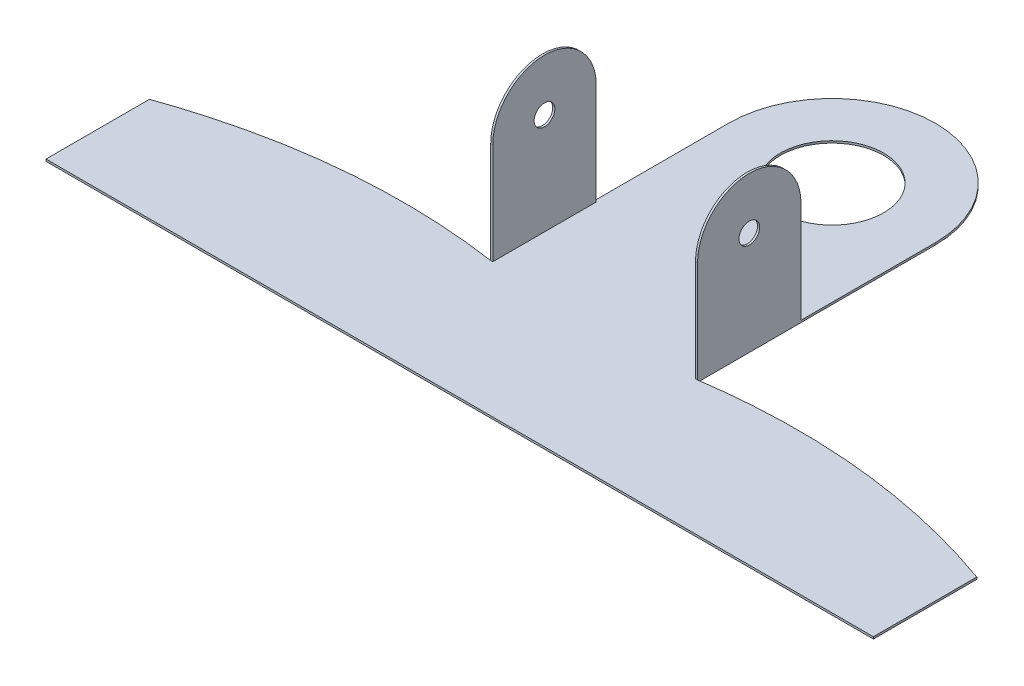
ISO-10303-21;
HEADER;
FILE_DESCRIPTION(('STEP AP214'),'2;1');
FILE_NAME('part.step','',(''),(''),'','','');
FILE_SCHEMA(('AUTOMOTIVE_DESIGN { 1 0 10303 214 1 1 1 1 }'));
ENDSEC;
DATA;
#1=APPLICATION_CONTEXT('core data for automotive mechanical design processes');
#2=APPLICATION_PROTOCOL_DEFINITION('international standard','automotive_design',2000,#1);
#3=PRODUCT_CONTEXT('',#1,'mechanical');
#4=PRODUCT('Part','Part','',(#3));
#5=PRODUCT_RELATED_PRODUCT_CATEGORY('part','',(#4));
#6=PRODUCT_DEFINITION_FORMATION('','',#4);
#7=PRODUCT_DEFINITION_CONTEXT('part definition',#1,'design');
#8=PRODUCT_DEFINITION('design','',#6,#7);
#9=PRODUCT_DEFINITION_SHAPE('','',#8);
#10=(LENGTH_UNIT() NAMED_UNIT(*) SI_UNIT(.MILLI.,.METRE.));
#11=(NAMED_UNIT(*) PLANE_ANGLE_UNIT() SI_UNIT($,.RADIAN.));
#12=(NAMED_UNIT(*) SI_UNIT($,.STERADIAN.) SOLID_ANGLE_UNIT());
#13=UNCERTAINTY_MEASURE_WITH_UNIT(LENGTH_MEASURE(1.E-05),#10,'distance_accuracy_value','');
#14=(GEOMETRIC_REPRESENTATION_CONTEXT(3) GLOBAL_UNCERTAINTY_ASSIGNED_CONTEXT((#13)) GLOBAL_UNIT_ASSIGNED_CONTEXT((#10,
#11,#12)) REPRESENTATION_CONTEXT('',''));
#15=CARTESIAN_POINT('',(0.,0.,0.));
#16=DIRECTION('',(0.,0.,1.));
#17=DIRECTION('',(1.,0.,0.));
#18=AXIS2_PLACEMENT_3D('',#15,#16,#17);
#19=CARTESIAN_POINT('',(0.,0.1,0.));
#20=DIRECTION('',(0.,1.,0.));
#21=DIRECTION('',(0.,0.,1.));
#22=AXIS2_PLACEMENT_3D('',#19,#20,#21);
#23=PLANE('',#22);
#24=DIRECTION('',(1.,0.,0.));
#25=VECTOR('',#24,1.);
#26=CARTESIAN_POINT('',(0.,0.1,23.));
#27=LINE('',#26,#25);
#28=CARTESIAN_POINT('',(-10.,0.1,23.));
#29=VERTEX_POINT('',#28);
#30=CARTESIAN_POINT('',(-9.8,0.1,23.));
#31=VERTEX_POINT('',#30);
#32=EDGE_CURVE('E145',#29,#31,#27,.T.);
#33=ORIENTED_EDGE('',*,*,#32,.F.);
#34=CARTESIAN_POINT('',(-10.,0.1,23.));
#35=CARTESIAN_POINT('',(-25.2852997120721,0.1,20.7808726208332));
#36=CARTESIAN_POINT('',(-40.,0.1,26.));
#37=B_SPLINE_CURVE_WITH_KNOTS('',2,(#34,#35,#36),.UNSPECIFIED.,.F.,.F.,(3,3),(0.,1.),.UNSPECIFIED.);
#38=CARTESIAN_POINT('',(-40.,0.1,26.));
#39=VERTEX_POINT('',#38);
#40=EDGE_CURVE('E227',#29,#39,#37,.T.);
#41=ORIENTED_EDGE('',*,*,#40,.T.);
#42=DIRECTION('',(0.,0.,1.));
#43=VECTOR('',#42,1.);
#44=CARTESIAN_POINT('',(-40.,0.1,26.));
#45=LINE('',#44,#43);
#46=CARTESIAN_POINT('',(-40.,0.1,36.));
#47=VERTEX_POINT('',#46);
#48=EDGE_CURVE('E232',#39,#47,#45,.T.);
#49=ORIENTED_EDGE('',*,*,#48,.T.);
#50=DIRECTION('',(1.,0.,0.));
#51=VECTOR('',#50,1.);
#52=CARTESIAN_POINT('',(40.,0.1,36.));
#53=LINE('',#52,#51);
#54=CARTESIAN_POINT('',(40.,0.1,36.));
#55=VERTEX_POINT('',#54);
#56=EDGE_CURVE('E554',#47,#55,#53,.T.);
#57=ORIENTED_EDGE('',*,*,#56,.T.);
#58=DIRECTION('',(0.,0.,-1.));
#59=VECTOR('',#58,1.);
#60=CARTESIAN_POINT('',(40.,0.1,26.));
#61=LINE('',#60,#59);
#62=CARTESIAN_POINT('',(40.,0.1,26.));
#63=VERTEX_POINT('',#62);
#64=EDGE_CURVE('E265',#55,#63,#61,.T.);
#65=ORIENTED_EDGE('',*,*,#64,.T.);
#66=CARTESIAN_POINT('',(40.,0.1,26.));
#67=CARTESIAN_POINT('',(25.2852997120721,0.1,20.7808726208332));
#68=CARTESIAN_POINT('',(10.,0.1,23.));
#69=B_SPLINE_CURVE_WITH_KNOTS('',2,(#66,#67,#68),.UNSPECIFIED.,.F.,.F.,(3,3),(0.,1.),.UNSPECIFIED.);
#70=CARTESIAN_POINT('',(10.,0.1,23.));
#71=VERTEX_POINT('',#70);
#72=EDGE_CURVE('E262',#63,#71,#69,.T.);
#73=ORIENTED_EDGE('',*,*,#72,.T.);
#74=DIRECTION('',(1.,0.,0.));
#75=VECTOR('',#74,1.);
#76=CARTESIAN_POINT('',(0.,0.1,23.));
#77=LINE('',#76,#75);
#78=CARTESIAN_POINT('',(9.8,0.1,23.));
#79=VERTEX_POINT('',#78);
#80=EDGE_CURVE('E207',#79,#71,#77,.T.);
#81=ORIENTED_EDGE('',*,*,#80,.F.);
#82=DIRECTION('',(0.,0.,-1.));
#83=VECTOR('',#82,1.);
#84=CARTESIAN_POINT('',(9.8,0.1,0.));
#85=LINE('',#84,#83);
#86=CARTESIAN_POINT('',(9.8,0.1,13.));
#87=VERTEX_POINT('',#86);
#88=EDGE_CURVE('E210',#79,#87,#85,.T.);
#89=ORIENTED_EDGE('',*,*,#88,.T.);
#90=DIRECTION('',(-1.,0.,0.));
#91=VECTOR('',#90,1.);
#92=CARTESIAN_POINT('',(0.,0.1,13.));
#93=LINE('',#92,#91);
#94=CARTESIAN_POINT('',(10.,0.1,13.));
#95=VERTEX_POINT('',#94);
#96=EDGE_CURVE('E205',#95,#87,#93,.T.);
#97=ORIENTED_EDGE('',*,*,#96,.F.);
#98=DIRECTION('',(0.,0.,-1.));
#99=VECTOR('',#98,1.);
#100=CARTESIAN_POINT('',(10.,0.1,0.));
#101=LINE('',#100,#99);
#102=CARTESIAN_POINT('',(10.,0.1,0.));
#103=VERTEX_POINT('',#102);
#104=EDGE_CURVE('E264',#95,#103,#101,.T.);
#105=ORIENTED_EDGE('',*,*,#104,.T.);
#106=CARTESIAN_POINT('',(0.,0.1,0.));
#107=DIRECTION('',(0.,1.,0.));
#108=DIRECTION('',(0.,0.,1.));
#109=AXIS2_PLACEMENT_3D('',#106,#107,#108);
#110=CIRCLE('',#109,10.);
#111=CARTESIAN_POINT('',(-10.,0.1,0.));
#112=VERTEX_POINT('',#111);
#113=EDGE_CURVE('E221',#103,#112,#110,.T.);
#114=ORIENTED_EDGE('',*,*,#113,.T.);
#115=DIRECTION('',(0.,0.,1.));
#116=VECTOR('',#115,1.);
#117=CARTESIAN_POINT('',(-10.,0.1,0.));
#118=LINE('',#117,#116);
#119=CARTESIAN_POINT('',(-10.,0.1,13.));
#120=VERTEX_POINT('',#119);
#121=EDGE_CURVE('E224',#112,#120,#118,.T.);
#122=ORIENTED_EDGE('',*,*,#121,.T.);
#123=DIRECTION('',(-1.,0.,0.));
#124=VECTOR('',#123,1.);
#125=CARTESIAN_POINT('',(0.,0.1,13.));
#126=LINE('',#125,#124);
#127=CARTESIAN_POINT('',(-9.8,0.1,13.));
#128=VERTEX_POINT('',#127);
#129=EDGE_CURVE('E53',#128,#120,#126,.T.);
#130=ORIENTED_EDGE('',*,*,#129,.F.);
#131=DIRECTION('',(0.,0.,1.));
#132=VECTOR('',#131,1.);
#133=CARTESIAN_POINT('',(-9.8,0.1,0.));
#134=LINE('',#133,#132);
#135=EDGE_CURVE('E48',#128,#31,#134,.T.);
#136=ORIENTED_EDGE('',*,*,#135,.T.);
#137=EDGE_LOOP('',(#33,#41,#49,#57,#65,#73,#81,#89,#97,#105,#114,#122,#130,#136));
#138=FACE_BOUND('',#137,.T.);
#139=CARTESIAN_POINT('',(0.,0.1,0.));
#140=DIRECTION('',(0.,1.,0.));
#141=DIRECTION('',(0.,0.,1.));
#142=AXIS2_PLACEMENT_3D('',#139,#140,#141);
#143=CIRCLE('',#142,5.);
#144=CARTESIAN_POINT('',(0.,0.1,5.));
#145=VERTEX_POINT('',#144);
#146=EDGE_CURVE('E215',#145,#145,#143,.T.);
#147=ORIENTED_EDGE('',*,*,#146,.F.);
#148=EDGE_LOOP('',(#147));
#149=FACE_BOUND('',#148,.T.);
#150=ADVANCED_FACE('F31',(#138,#149),#23,.T.);
#151=CARTESIAN_POINT('',(0.,-0.1,0.));
#152=DIRECTION('',(0.,1.,0.));
#153=DIRECTION('',(0.,0.,1.));
#154=AXIS2_PLACEMENT_3D('',#151,#152,#153);
#155=PLANE('',#154);
#156=CARTESIAN_POINT('',(-10.,-0.1,23.));
#157=CARTESIAN_POINT('',(-25.2852997120721,-0.1,20.7808726208332));
#158=CARTESIAN_POINT('',(-40.,-0.1,26.));
#159=B_SPLINE_CURVE_WITH_KNOTS('',2,(#156,#157,#158),.UNSPECIFIED.,.F.,.F.,(3,3),(0.,1.),.UNSPECIFIED.);
#160=CARTESIAN_POINT('',(-10.,-0.1,23.));
#161=VERTEX_POINT('',#160);
#162=CARTESIAN_POINT('',(-40.,-0.1,26.));
#163=VERTEX_POINT('',#162);
#164=EDGE_CURVE('E364',#161,#163,#159,.T.);
#165=ORIENTED_EDGE('',*,*,#164,.F.);
#166=DIRECTION('',(0.,0.,1.));
#167=VECTOR('',#166,1.);
#168=CARTESIAN_POINT('',(-10.,-0.1,0.));
#169=LINE('',#168,#167);
#170=CARTESIAN_POINT('',(-10.,-0.1,0.));
#171=VERTEX_POINT('',#170);
#172=EDGE_CURVE('E360',#171,#161,#169,.T.);
#173=ORIENTED_EDGE('',*,*,#172,.F.);
#174=CARTESIAN_POINT('',(0.,-0.1,0.));
#175=DIRECTION('',(0.,1.,0.));
#176=DIRECTION('',(0.,0.,1.));
#177=AXIS2_PLACEMENT_3D('',#174,#175,#176);
#178=CIRCLE('',#177,10.);
#179=CARTESIAN_POINT('',(10.,-0.1,0.));
#180=VERTEX_POINT('',#179);
#181=EDGE_CURVE('E218',#180,#171,#178,.T.);
#182=ORIENTED_EDGE('',*,*,#181,.F.);
#183=DIRECTION('',(0.,0.,-1.));
#184=VECTOR('',#183,1.);
#185=CARTESIAN_POINT('',(10.,-0.1,0.));
#186=LINE('',#185,#184);
#187=CARTESIAN_POINT('',(10.,-0.1,23.));
#188=VERTEX_POINT('',#187);
#189=EDGE_CURVE('E225',#188,#180,#186,.T.);
#190=ORIENTED_EDGE('',*,*,#189,.F.);
#191=CARTESIAN_POINT('',(40.,-0.1,26.));
#192=CARTESIAN_POINT('',(25.2852997120721,-0.1,20.7808726208332));
#193=CARTESIAN_POINT('',(10.,-0.1,23.));
#194=B_SPLINE_CURVE_WITH_KNOTS('',2,(#191,#192,#193),.UNSPECIFIED.,.F.,.F.,(3,3),(0.,1.),.UNSPECIFIED.);
#195=CARTESIAN_POINT('',(40.,-0.1,26.));
#196=VERTEX_POINT('',#195);
#197=EDGE_CURVE('E379',#196,#188,#194,.T.);
#198=ORIENTED_EDGE('',*,*,#197,.F.);
#199=DIRECTION('',(0.,0.,-1.));
#200=VECTOR('',#199,1.);
#201=CARTESIAN_POINT('',(40.,-0.1,26.));
#202=LINE('',#201,#200);
#203=CARTESIAN_POINT('',(40.,-0.1,36.));
#204=VERTEX_POINT('',#203);
#205=EDGE_CURVE('E377',#204,#196,#202,.T.);
#206=ORIENTED_EDGE('',*,*,#205,.F.);
#207=DIRECTION('',(1.,0.,0.));
#208=VECTOR('',#207,1.);
#209=CARTESIAN_POINT('',(40.,-0.1,36.));
#210=LINE('',#209,#208);
#211=CARTESIAN_POINT('',(-40.,-0.1,36.));
#212=VERTEX_POINT('',#211);
#213=EDGE_CURVE('E375',#212,#204,#210,.T.);
#214=ORIENTED_EDGE('',*,*,#213,.F.);
#215=DIRECTION('',(0.,0.,1.));
#216=VECTOR('',#215,1.);
#217=CARTESIAN_POINT('',(-40.,-0.1,26.));
#218=LINE('',#217,#216);
#219=EDGE_CURVE('E366',#163,#212,#218,.T.);
#220=ORIENTED_EDGE('',*,*,#219,.F.);
#221=EDGE_LOOP('',(#165,#173,#182,#190,#198,#206,#214,#220));
#222=FACE_BOUND('',#221,.T.);
#223=CARTESIAN_POINT('',(0.,-0.1,0.));
#224=DIRECTION('',(0.,1.,0.));
#225=DIRECTION('',(0.,0.,1.));
#226=AXIS2_PLACEMENT_3D('',#223,#224,#225);
#227=CIRCLE('',#226,5.);
#228=CARTESIAN_POINT('',(0.,-0.1,5.));
#229=VERTEX_POINT('',#228);
#230=EDGE_CURVE('E214',#229,#229,#227,.T.);
#231=ORIENTED_EDGE('',*,*,#230,.T.);
#232=EDGE_LOOP('',(#231));
#233=FACE_BOUND('',#232,.T.);
#234=ADVANCED_FACE('F299',(#222,#233),#155,.F.);
#235=CARTESIAN_POINT('',(0.,0.1,0.));
#236=DIRECTION('',(0.,-1.,0.));
#237=DIRECTION('',(0.,0.,-1.));
#238=AXIS2_PLACEMENT_3D('',#235,#236,#237);
#239=CYLINDRICAL_SURFACE('',#238,10.);
#240=ORIENTED_EDGE('',*,*,#181,.T.);
#241=DIRECTION('',(0.,-1.,0.));
#242=VECTOR('',#241,1.);
#243=CARTESIAN_POINT('',(-10.,0.1,0.));
#244=LINE('',#243,#242);
#245=EDGE_CURVE('E11',#112,#171,#244,.T.);
#246=ORIENTED_EDGE('',*,*,#245,.F.);
#247=ORIENTED_EDGE('',*,*,#113,.F.);
#248=DIRECTION('',(0.,-1.,0.));
#249=VECTOR('',#248,1.);
#250=CARTESIAN_POINT('',(10.,0.1,0.));
#251=LINE('',#250,#249);
#252=EDGE_CURVE('E387',#103,#180,#251,.T.);
#253=ORIENTED_EDGE('',*,*,#252,.T.);
#254=EDGE_LOOP('',(#240,#246,#247,#253));
#255=FACE_BOUND('',#254,.T.);
#256=ADVANCED_FACE('F33',(#255),#239,.T.);
#257=CARTESIAN_POINT('',(-10.,0.1,0.));
#258=DIRECTION('',(1.,0.,0.));
#259=DIRECTION('',(0.,0.,-1.));
#260=AXIS2_PLACEMENT_3D('',#257,#258,#259);
#261=PLANE('',#260);
#262=ORIENTED_EDGE('',*,*,#172,.T.);
#263=DIRECTION('',(0.,-1.,0.));
#264=VECTOR('',#263,1.);
#265=CARTESIAN_POINT('',(-10.,0.1,23.));
#266=LINE('',#265,#264);
#267=EDGE_CURVE('E40',#29,#161,#266,.T.);
#268=ORIENTED_EDGE('',*,*,#267,.F.);
#269=DIRECTION('',(0.,1.,0.));
#270=VECTOR('',#269,1.);
#271=CARTESIAN_POINT('',(-10.,-0.1,23.));
#272=LINE('',#271,#270);
#273=CARTESIAN_POINT('',(-10.,9.9,23.));
#274=VERTEX_POINT('',#273);
#275=EDGE_CURVE('E171',#29,#274,#272,.T.);
#276=ORIENTED_EDGE('',*,*,#275,.T.);
#277=CARTESIAN_POINT('',(-10.,9.9,18.));
#278=DIRECTION('',(-1.,0.,0.));
#279=DIRECTION('',(0.,0.,1.));
#280=AXIS2_PLACEMENT_3D('',#277,#278,#279);
#281=CIRCLE('',#280,5.);
#282=CARTESIAN_POINT('',(-10.,9.9,13.));
#283=VERTEX_POINT('',#282);
#284=EDGE_CURVE('E155',#274,#283,#281,.T.);
#285=ORIENTED_EDGE('',*,*,#284,.T.);
#286=DIRECTION('',(0.,-1.,0.));
#287=VECTOR('',#286,1.);
#288=CARTESIAN_POINT('',(-10.,-0.100000000000001,13.));
#289=LINE('',#288,#287);
#290=EDGE_CURVE('E149',#283,#120,#289,.T.);
#291=ORIENTED_EDGE('',*,*,#290,.T.);
#292=ORIENTED_EDGE('',*,*,#121,.F.);
#293=ORIENTED_EDGE('',*,*,#245,.T.);
#294=EDGE_LOOP('',(#262,#268,#276,#285,#291,#292,#293));
#295=FACE_BOUND('',#294,.T.);
#296=CARTESIAN_POINT('',(-10.,9.9,18.));
#297=DIRECTION('',(-1.,0.,0.));
#298=DIRECTION('',(0.,0.,1.));
#299=AXIS2_PLACEMENT_3D('',#296,#297,#298);
#300=CIRCLE('',#299,1.);
#301=CARTESIAN_POINT('',(-10.,9.9,19.));
#302=VERTEX_POINT('',#301);
#303=EDGE_CURVE('E351',#302,#302,#300,.T.);
#304=ORIENTED_EDGE('',*,*,#303,.F.);
#305=EDGE_LOOP('',(#304));
#306=FACE_BOUND('',#305,.T.);
#307=ADVANCED_FACE('F297',(#295,#306),#261,.F.);
#308=DIRECTION('',(0.,-1.,0.));
#309=VECTOR('',#308,1.);
#310=SURFACE_OF_LINEAR_EXTRUSION('',#37,#309);
#311=ORIENTED_EDGE('',*,*,#164,.T.);
#312=DIRECTION('',(0.,-1.,0.));
#313=VECTOR('',#312,1.);
#314=CARTESIAN_POINT('',(-40.,0.1,26.));
#315=LINE('',#314,#313);
#316=EDGE_CURVE('E246',#39,#163,#315,.T.);
#317=ORIENTED_EDGE('',*,*,#316,.F.);
#318=ORIENTED_EDGE('',*,*,#40,.F.);
#319=ORIENTED_EDGE('',*,*,#267,.T.);
#320=EDGE_LOOP('',(#311,#317,#318,#319));
#321=FACE_BOUND('',#320,.T.);
#322=ADVANCED_FACE('F239',(#321),#310,.F.);
#323=CARTESIAN_POINT('',(-40.,0.1,26.));
#324=DIRECTION('',(1.,0.,0.));
#325=DIRECTION('',(0.,0.,-1.));
#326=AXIS2_PLACEMENT_3D('',#323,#324,#325);
#327=PLANE('',#326);
#328=ORIENTED_EDGE('',*,*,#219,.T.);
#329=DIRECTION('',(0.,-1.,0.));
#330=VECTOR('',#329,1.);
#331=CARTESIAN_POINT('',(-40.,0.1,36.));
#332=LINE('',#331,#330);
#333=EDGE_CURVE('E251',#47,#212,#332,.T.);
#334=ORIENTED_EDGE('',*,*,#333,.F.);
#335=ORIENTED_EDGE('',*,*,#48,.F.);
#336=ORIENTED_EDGE('',*,*,#316,.T.);
#337=EDGE_LOOP('',(#328,#334,#335,#336));
#338=FACE_BOUND('',#337,.T.);
#339=ADVANCED_FACE('F291',(#338),#327,.F.);
#340=CARTESIAN_POINT('',(40.,0.1,36.));
#341=DIRECTION('',(0.,0.,-1.));
#342=DIRECTION('',(-1.,0.,0.));
#343=AXIS2_PLACEMENT_3D('',#340,#341,#342);
#344=PLANE('',#343);
#345=ORIENTED_EDGE('',*,*,#213,.T.);
#346=DIRECTION('',(0.,-1.,0.));
#347=VECTOR('',#346,1.);
#348=CARTESIAN_POINT('',(40.,0.1,36.));
#349=LINE('',#348,#347);
#350=EDGE_CURVE('E258',#55,#204,#349,.T.);
#351=ORIENTED_EDGE('',*,*,#350,.F.);
#352=ORIENTED_EDGE('',*,*,#56,.F.);
#353=ORIENTED_EDGE('',*,*,#333,.T.);
#354=EDGE_LOOP('',(#345,#351,#352,#353));
#355=FACE_BOUND('',#354,.T.);
#356=ADVANCED_FACE('F288',(#355),#344,.F.);
#357=CARTESIAN_POINT('',(40.,0.1,26.));
#358=DIRECTION('',(-1.,0.,0.));
#359=DIRECTION('',(0.,0.,1.));
#360=AXIS2_PLACEMENT_3D('',#357,#358,#359);
#361=PLANE('',#360);
#362=ORIENTED_EDGE('',*,*,#205,.T.);
#363=DIRECTION('',(0.,-1.,0.));
#364=VECTOR('',#363,1.);
#365=CARTESIAN_POINT('',(40.,0.1,26.));
#366=LINE('',#365,#364);
#367=EDGE_CURVE('E390',#63,#196,#366,.T.);
#368=ORIENTED_EDGE('',*,*,#367,.F.);
#369=ORIENTED_EDGE('',*,*,#64,.F.);
#370=ORIENTED_EDGE('',*,*,#350,.T.);
#371=EDGE_LOOP('',(#362,#368,#369,#370));
#372=FACE_BOUND('',#371,.T.);
#373=ADVANCED_FACE('F283',(#372),#361,.F.);
#374=DIRECTION('',(0.,-1.,0.));
#375=VECTOR('',#374,1.);
#376=SURFACE_OF_LINEAR_EXTRUSION('',#69,#375);
#377=ORIENTED_EDGE('',*,*,#197,.T.);
#378=DIRECTION('',(0.,-1.,0.));
#379=VECTOR('',#378,1.);
#380=CARTESIAN_POINT('',(10.,0.1,23.));
#381=LINE('',#380,#379);
#382=EDGE_CURVE('E266',#71,#188,#381,.T.);
#383=ORIENTED_EDGE('',*,*,#382,.F.);
#384=ORIENTED_EDGE('',*,*,#72,.F.);
#385=ORIENTED_EDGE('',*,*,#367,.T.);
#386=EDGE_LOOP('',(#377,#383,#384,#385));
#387=FACE_BOUND('',#386,.T.);
#388=ADVANCED_FACE('F278',(#387),#376,.F.);
#389=CARTESIAN_POINT('',(10.,0.1,0.));
#390=DIRECTION('',(-1.,0.,0.));
#391=DIRECTION('',(0.,0.,1.));
#392=AXIS2_PLACEMENT_3D('',#389,#390,#391);
#393=PLANE('',#392);
#394=ORIENTED_EDGE('',*,*,#104,.F.);
#395=DIRECTION('',(0.,1.,0.));
#396=VECTOR('',#395,1.);
#397=CARTESIAN_POINT('',(10.,-0.1,13.));
#398=LINE('',#397,#396);
#399=CARTESIAN_POINT('',(10.,9.9,13.));
#400=VERTEX_POINT('',#399);
#401=EDGE_CURVE('E199',#95,#400,#398,.T.);
#402=ORIENTED_EDGE('',*,*,#401,.T.);
#403=CARTESIAN_POINT('',(10.,9.9,18.));
#404=DIRECTION('',(1.,0.,0.));
#405=DIRECTION('',(0.,0.,-1.));
#406=AXIS2_PLACEMENT_3D('',#403,#404,#405);
#407=CIRCLE('',#406,5.);
#408=CARTESIAN_POINT('',(10.,9.9,23.));
#409=VERTEX_POINT('',#408);
#410=EDGE_CURVE('E191',#400,#409,#407,.T.);
#411=ORIENTED_EDGE('',*,*,#410,.T.);
#412=DIRECTION('',(0.,-1.,0.));
#413=VECTOR('',#412,1.);
#414=CARTESIAN_POINT('',(10.,-0.1,23.));
#415=LINE('',#414,#413);
#416=EDGE_CURVE('E184',#409,#71,#415,.T.);
#417=ORIENTED_EDGE('',*,*,#416,.T.);
#418=ORIENTED_EDGE('',*,*,#382,.T.);
#419=ORIENTED_EDGE('',*,*,#189,.T.);
#420=ORIENTED_EDGE('',*,*,#252,.F.);
#421=EDGE_LOOP('',(#394,#402,#411,#417,#418,#419,#420));
#422=FACE_BOUND('',#421,.T.);
#423=CARTESIAN_POINT('',(10.,9.9,18.));
#424=DIRECTION('',(1.,0.,0.));
#425=DIRECTION('',(0.,0.,-1.));
#426=AXIS2_PLACEMENT_3D('',#423,#424,#425);
#427=CIRCLE('',#426,1.);
#428=CARTESIAN_POINT('',(10.,9.9,17.));
#429=VERTEX_POINT('',#428);
#430=EDGE_CURVE('E180',#429,#429,#427,.T.);
#431=ORIENTED_EDGE('',*,*,#430,.F.);
#432=EDGE_LOOP('',(#431));
#433=FACE_BOUND('',#432,.T.);
#434=ADVANCED_FACE('F282',(#422,#433),#393,.F.);
#435=CARTESIAN_POINT('',(0.,0.1,0.));
#436=DIRECTION('',(0.,-1.,0.));
#437=DIRECTION('',(0.,0.,-1.));
#438=AXIS2_PLACEMENT_3D('',#435,#436,#437);
#439=CYLINDRICAL_SURFACE('',#438,5.);
#440=ORIENTED_EDGE('',*,*,#146,.T.);
#441=EDGE_LOOP('',(#440));
#442=FACE_BOUND('',#441,.T.);
#443=ORIENTED_EDGE('',*,*,#230,.F.);
#444=EDGE_LOOP('',(#443));
#445=FACE_BOUND('',#444,.T.);
#446=ADVANCED_FACE('F307',(#442,#445),#439,.F.);
#447=CARTESIAN_POINT('',(9.8,-0.1,23.));
#448=DIRECTION('',(0.,0.,1.));
#449=DIRECTION('',(1.,0.,0.));
#450=AXIS2_PLACEMENT_3D('',#447,#448,#449);
#451=PLANE('',#450);
#452=DIRECTION('',(0.,-1.,0.));
#453=VECTOR('',#452,1.);
#454=CARTESIAN_POINT('',(9.8,-0.1,23.));
#455=LINE('',#454,#453);
#456=CARTESIAN_POINT('',(9.8,9.9,23.));
#457=VERTEX_POINT('',#456);
#458=EDGE_CURVE('E187',#457,#79,#455,.T.);
#459=ORIENTED_EDGE('',*,*,#458,.T.);
#460=ORIENTED_EDGE('',*,*,#80,.T.);
#461=ORIENTED_EDGE('',*,*,#416,.F.);
#462=DIRECTION('',(1.,0.,0.));
#463=VECTOR('',#462,1.);
#464=CARTESIAN_POINT('',(9.8,9.9,23.));
#465=LINE('',#464,#463);
#466=EDGE_CURVE('E411',#457,#409,#465,.T.);
#467=ORIENTED_EDGE('',*,*,#466,.F.);
#468=EDGE_LOOP('',(#459,#460,#461,#467));
#469=FACE_BOUND('',#468,.T.);
#470=ADVANCED_FACE('F310',(#469),#451,.T.);
#471=CARTESIAN_POINT('',(9.8,9.9,18.));
#472=DIRECTION('',(1.,0.,0.));
#473=DIRECTION('',(0.,0.,-1.));
#474=AXIS2_PLACEMENT_3D('',#471,#472,#473);
#475=CYLINDRICAL_SURFACE('',#474,5.);
#476=ORIENTED_EDGE('',*,*,#410,.F.);
#477=DIRECTION('',(1.,0.,0.));
#478=VECTOR('',#477,1.);
#479=CARTESIAN_POINT('',(9.8,9.9,13.));
#480=LINE('',#479,#478);
#481=CARTESIAN_POINT('',(9.8,9.9,13.));
#482=VERTEX_POINT('',#481);
#483=EDGE_CURVE('E196',#482,#400,#480,.T.);
#484=ORIENTED_EDGE('',*,*,#483,.F.);
#485=CARTESIAN_POINT('',(9.8,9.9,18.));
#486=DIRECTION('',(1.,0.,0.));
#487=DIRECTION('',(0.,0.,-1.));
#488=AXIS2_PLACEMENT_3D('',#485,#486,#487);
#489=CIRCLE('',#488,5.);
#490=EDGE_CURVE('E193',#482,#457,#489,.T.);
#491=ORIENTED_EDGE('',*,*,#490,.T.);
#492=ORIENTED_EDGE('',*,*,#466,.T.);
#493=EDGE_LOOP('',(#476,#484,#491,#492));
#494=FACE_BOUND('',#493,.T.);
#495=ADVANCED_FACE('F314',(#494),#475,.T.);
#496=CARTESIAN_POINT('',(9.8,-0.1,13.));
#497=DIRECTION('',(0.,0.,-1.));
#498=DIRECTION('',(-1.,0.,0.));
#499=AXIS2_PLACEMENT_3D('',#496,#497,#498);
#500=PLANE('',#499);
#501=ORIENTED_EDGE('',*,*,#401,.F.);
#502=ORIENTED_EDGE('',*,*,#96,.T.);
#503=DIRECTION('',(0.,1.,0.));
#504=VECTOR('',#503,1.);
#505=CARTESIAN_POINT('',(9.8,-0.1,13.));
#506=LINE('',#505,#504);
#507=EDGE_CURVE('E190',#87,#482,#506,.T.);
#508=ORIENTED_EDGE('',*,*,#507,.T.);
#509=ORIENTED_EDGE('',*,*,#483,.T.);
#510=EDGE_LOOP('',(#501,#502,#508,#509));
#511=FACE_BOUND('',#510,.T.);
#512=ADVANCED_FACE('F316',(#511),#500,.T.);
#513=CARTESIAN_POINT('',(9.8,9.9,18.));
#514=DIRECTION('',(1.,0.,0.));
#515=DIRECTION('',(0.,0.,-1.));
#516=AXIS2_PLACEMENT_3D('',#513,#514,#515);
#517=PLANE('',#516);
#518=ORIENTED_EDGE('',*,*,#88,.F.);
#519=ORIENTED_EDGE('',*,*,#458,.F.);
#520=ORIENTED_EDGE('',*,*,#490,.F.);
#521=ORIENTED_EDGE('',*,*,#507,.F.);
#522=EDGE_LOOP('',(#518,#519,#520,#521));
#523=FACE_BOUND('',#522,.T.);
#524=CARTESIAN_POINT('',(9.8,9.9,18.));
#525=DIRECTION('',(1.,0.,0.));
#526=DIRECTION('',(0.,0.,-1.));
#527=AXIS2_PLACEMENT_3D('',#524,#525,#526);
#528=CIRCLE('',#527,1.);
#529=CARTESIAN_POINT('',(9.8,9.9,17.));
#530=VERTEX_POINT('',#529);
#531=EDGE_CURVE('E181',#530,#530,#528,.T.);
#532=ORIENTED_EDGE('',*,*,#531,.T.);
#533=EDGE_LOOP('',(#532));
#534=FACE_BOUND('',#533,.T.);
#535=ADVANCED_FACE('F319',(#523,#534),#517,.F.);
#536=CARTESIAN_POINT('',(9.8,9.9,18.));
#537=DIRECTION('',(1.,0.,0.));
#538=DIRECTION('',(0.,0.,-1.));
#539=AXIS2_PLACEMENT_3D('',#536,#537,#538);
#540=CYLINDRICAL_SURFACE('',#539,1.);
#541=ORIENTED_EDGE('',*,*,#531,.F.);
#542=EDGE_LOOP('',(#541));
#543=FACE_BOUND('',#542,.T.);
#544=ORIENTED_EDGE('',*,*,#430,.T.);
#545=EDGE_LOOP('',(#544));
#546=FACE_BOUND('',#545,.T.);
#547=ADVANCED_FACE('F326',(#543,#546),#540,.F.);
#548=CARTESIAN_POINT('',(-9.8,-0.1,23.));
#549=DIRECTION('',(0.,0.,1.));
#550=DIRECTION('',(1.,0.,0.));
#551=AXIS2_PLACEMENT_3D('',#548,#549,#550);
#552=PLANE('',#551);
#553=ORIENTED_EDGE('',*,*,#275,.F.);
#554=ORIENTED_EDGE('',*,*,#32,.T.);
#555=DIRECTION('',(0.,1.,0.));
#556=VECTOR('',#555,1.);
#557=CARTESIAN_POINT('',(-9.8,-0.1,23.));
#558=LINE('',#557,#556);
#559=CARTESIAN_POINT('',(-9.8,9.9,23.));
#560=VERTEX_POINT('',#559);
#561=EDGE_CURVE('E139',#31,#560,#558,.T.);
#562=ORIENTED_EDGE('',*,*,#561,.T.);
#563=DIRECTION('',(-1.,0.,0.));
#564=VECTOR('',#563,1.);
#565=CARTESIAN_POINT('',(-9.8,9.9,23.));
#566=LINE('',#565,#564);
#567=EDGE_CURVE('E143',#560,#274,#566,.T.);
#568=ORIENTED_EDGE('',*,*,#567,.T.);
#569=EDGE_LOOP('',(#553,#554,#562,#568));
#570=FACE_BOUND('',#569,.T.);
#571=ADVANCED_FACE('F142',(#570),#552,.T.);
#572=CARTESIAN_POINT('',(-9.8,-0.100000000000001,13.));
#573=DIRECTION('',(0.,0.,-1.));
#574=DIRECTION('',(-1.,0.,0.));
#575=AXIS2_PLACEMENT_3D('',#572,#573,#574);
#576=PLANE('',#575);
#577=DIRECTION('',(0.,-1.,0.));
#578=VECTOR('',#577,1.);
#579=CARTESIAN_POINT('',(-9.8,-0.100000000000001,13.));
#580=LINE('',#579,#578);
#581=CARTESIAN_POINT('',(-9.8,9.9,13.));
#582=VERTEX_POINT('',#581);
#583=EDGE_CURVE('E157',#582,#128,#580,.T.);
#584=ORIENTED_EDGE('',*,*,#583,.T.);
#585=ORIENTED_EDGE('',*,*,#129,.T.);
#586=ORIENTED_EDGE('',*,*,#290,.F.);
#587=DIRECTION('',(-1.,0.,0.));
#588=VECTOR('',#587,1.);
#589=CARTESIAN_POINT('',(-9.8,9.9,13.));
#590=LINE('',#589,#588);
#591=EDGE_CURVE('E156',#582,#283,#590,.T.);
#592=ORIENTED_EDGE('',*,*,#591,.F.);
#593=EDGE_LOOP('',(#584,#585,#586,#592));
#594=FACE_BOUND('',#593,.T.);
#595=ADVANCED_FACE('F333',(#594),#576,.T.);
#596=CARTESIAN_POINT('',(-9.8,9.9,18.));
#597=DIRECTION('',(-1.,0.,0.));
#598=DIRECTION('',(0.,0.,1.));
#599=AXIS2_PLACEMENT_3D('',#596,#597,#598);
#600=CYLINDRICAL_SURFACE('',#599,5.);
#601=ORIENTED_EDGE('',*,*,#284,.F.);
#602=ORIENTED_EDGE('',*,*,#567,.F.);
#603=CARTESIAN_POINT('',(-9.8,9.9,18.));
#604=DIRECTION('',(-1.,0.,0.));
#605=DIRECTION('',(0.,0.,1.));
#606=AXIS2_PLACEMENT_3D('',#603,#604,#605);
#607=CIRCLE('',#606,5.);
#608=EDGE_CURVE('E148',#560,#582,#607,.T.);
#609=ORIENTED_EDGE('',*,*,#608,.T.);
#610=ORIENTED_EDGE('',*,*,#591,.T.);
#611=EDGE_LOOP('',(#601,#602,#609,#610));
#612=FACE_BOUND('',#611,.T.);
#613=ADVANCED_FACE('F153',(#612),#600,.T.);
#614=CARTESIAN_POINT('',(-9.8,9.9,18.));
#615=DIRECTION('',(-1.,0.,0.));
#616=DIRECTION('',(0.,0.,1.));
#617=AXIS2_PLACEMENT_3D('',#614,#615,#616);
#618=PLANE('',#617);
#619=ORIENTED_EDGE('',*,*,#135,.F.);
#620=ORIENTED_EDGE('',*,*,#583,.F.);
#621=ORIENTED_EDGE('',*,*,#608,.F.);
#622=ORIENTED_EDGE('',*,*,#561,.F.);
#623=EDGE_LOOP('',(#619,#620,#621,#622));
#624=FACE_BOUND('',#623,.T.);
#625=CARTESIAN_POINT('',(-9.8,9.9,18.));
#626=DIRECTION('',(-1.,0.,0.));
#627=DIRECTION('',(0.,0.,1.));
#628=AXIS2_PLACEMENT_3D('',#625,#626,#627);
#629=CIRCLE('',#628,1.);
#630=CARTESIAN_POINT('',(-9.8,9.9,19.));
#631=VERTEX_POINT('',#630);
#632=EDGE_CURVE('E173',#631,#631,#629,.T.);
#633=ORIENTED_EDGE('',*,*,#632,.T.);
#634=EDGE_LOOP('',(#633));
#635=FACE_BOUND('',#634,.T.);
#636=ADVANCED_FACE('F160',(#624,#635),#618,.F.);
#637=CARTESIAN_POINT('',(-9.8,9.9,18.));
#638=DIRECTION('',(-1.,0.,0.));
#639=DIRECTION('',(0.,0.,1.));
#640=AXIS2_PLACEMENT_3D('',#637,#638,#639);
#641=CYLINDRICAL_SURFACE('',#640,1.);
#642=ORIENTED_EDGE('',*,*,#632,.F.);
#643=EDGE_LOOP('',(#642));
#644=FACE_BOUND('',#643,.T.);
#645=ORIENTED_EDGE('',*,*,#303,.T.);
#646=EDGE_LOOP('',(#645));
#647=FACE_BOUND('',#646,.T.);
#648=ADVANCED_FACE('F341',(#644,#647),#641,.F.);
#649=CLOSED_SHELL('',(#150,#234,#256,#307,#322,#339,#356,#373,#388,#434,#446,#470,#495,#512,
#535,#547,#571,#595,#613,#636,#648));
#650=MANIFOLD_SOLID_BREP('B2',#649);
#651=ADVANCED_BREP_SHAPE_REPRESENTATION('',(#18,#650),#14);
#652=SHAPE_DEFINITION_REPRESENTATION(#9,#651);
ENDSEC;
END-ISO-10303-21;
